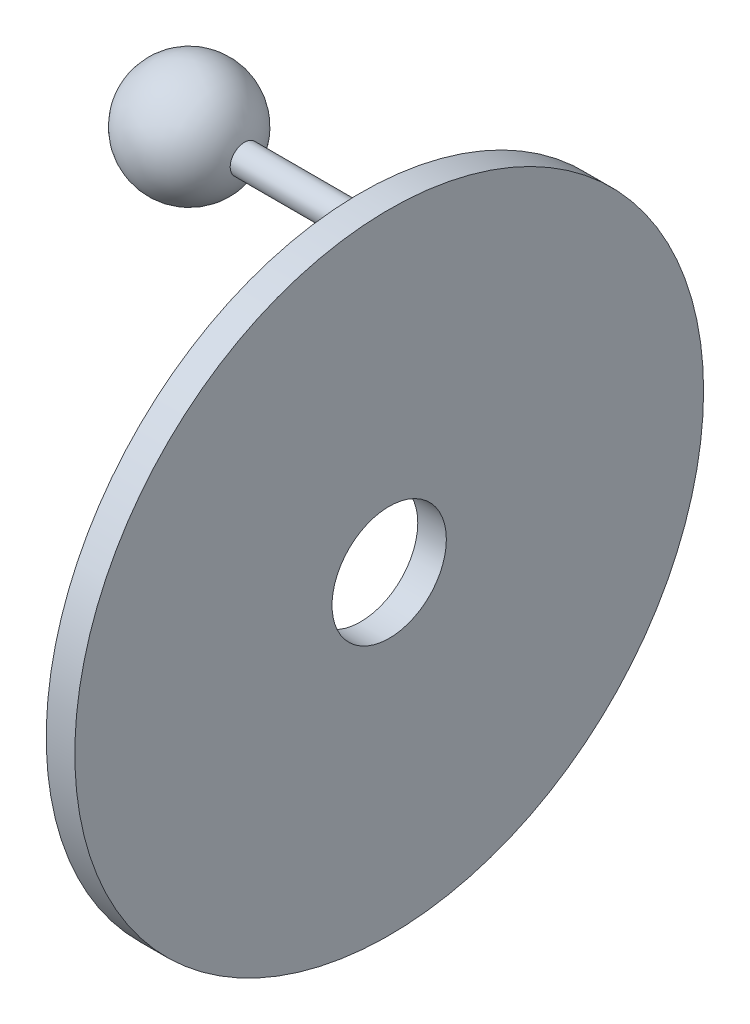
ISO-10303-21;
HEADER;
FILE_DESCRIPTION(('STEP AP214'),'2;1');
FILE_NAME('part.step','',(''),(''),'','','');
FILE_SCHEMA(('AUTOMOTIVE_DESIGN { 1 0 10303 214 1 1 1 1 }'));
ENDSEC;
DATA;
#1=APPLICATION_CONTEXT('core data for automotive mechanical design processes');
#2=APPLICATION_PROTOCOL_DEFINITION('international standard','automotive_design',2000,#1);
#3=PRODUCT_CONTEXT('',#1,'mechanical');
#4=PRODUCT('Part','Part','',(#3));
#5=PRODUCT_RELATED_PRODUCT_CATEGORY('part','',(#4));
#6=PRODUCT_DEFINITION_FORMATION('','',#4);
#7=PRODUCT_DEFINITION_CONTEXT('part definition',#1,'design');
#8=PRODUCT_DEFINITION('design','',#6,#7);
#9=PRODUCT_DEFINITION_SHAPE('','',#8);
#10=(LENGTH_UNIT() NAMED_UNIT(*) SI_UNIT(.MILLI.,.METRE.));
#11=(NAMED_UNIT(*) PLANE_ANGLE_UNIT() SI_UNIT($,.RADIAN.));
#12=(NAMED_UNIT(*) SI_UNIT($,.STERADIAN.) SOLID_ANGLE_UNIT());
#13=UNCERTAINTY_MEASURE_WITH_UNIT(LENGTH_MEASURE(1.E-05),#10,'distance_accuracy_value','');
#14=(GEOMETRIC_REPRESENTATION_CONTEXT(3) GLOBAL_UNCERTAINTY_ASSIGNED_CONTEXT((#13)) GLOBAL_UNIT_ASSIGNED_CONTEXT((#10,
#11,#12)) REPRESENTATION_CONTEXT('',''));
#15=CARTESIAN_POINT('',(0.,0.,0.));
#16=DIRECTION('',(0.,0.,1.));
#17=DIRECTION('',(1.,0.,0.));
#18=AXIS2_PLACEMENT_3D('',#15,#16,#17);
#19=CARTESIAN_POINT('',(0.,0.,0.));
#20=DIRECTION('',(0.,1.,0.));
#21=DIRECTION('',(1.,0.,0.));
#22=AXIS2_PLACEMENT_3D('',#19,#20,#21);
#23=SPHERICAL_SURFACE('',#22,10.);
#24=CARTESIAN_POINT('',(0.,0.,0.));
#25=DIRECTION('',(-1.,0.,0.));
#26=DIRECTION('',(0.,0.,1.));
#27=AXIS2_PLACEMENT_3D('',#24,#25,#26);
#28=SPHERICAL_SURFACE('',#27,10.);
#29=CARTESIAN_POINT('',(9.68245836551854,0.,0.));
#30=DIRECTION('',(-1.,0.,0.));
#31=DIRECTION('',(0.,0.,1.));
#32=AXIS2_PLACEMENT_3D('',#29,#30,#31);
#33=CIRCLE('',#32,2.5);
#34=CARTESIAN_POINT('',(9.68245836551854,0.,2.5));
#35=VERTEX_POINT('',#34);
#36=EDGE_CURVE('E10',#35,#35,#33,.F.);
#37=ORIENTED_EDGE('',*,*,#36,.F.);
#38=EDGE_LOOP('',(#37));
#39=FACE_BOUND('',#38,.T.);
#40=ADVANCED_FACE('F14',(#39),#28,.T.);
#41=CARTESIAN_POINT('',(0.,0.,0.));
#42=DIRECTION('',(-1.,0.,0.));
#43=DIRECTION('',(0.,0.,1.));
#44=AXIS2_PLACEMENT_3D('',#41,#42,#43);
#45=CYLINDRICAL_SURFACE('',#44,2.5);
#46=CARTESIAN_POINT('',(30.,0.,0.));
#47=DIRECTION('',(1.,0.,0.));
#48=DIRECTION('',(0.,0.,-1.));
#49=AXIS2_PLACEMENT_3D('',#46,#47,#48);
#50=CIRCLE('',#49,2.5);
#51=CARTESIAN_POINT('',(30.,0.,-2.5));
#52=VERTEX_POINT('',#51);
#53=EDGE_CURVE('E20',#52,#52,#50,.T.);
#54=ORIENTED_EDGE('',*,*,#53,.F.);
#55=EDGE_LOOP('',(#54));
#56=FACE_BOUND('',#55,.T.);
#57=ORIENTED_EDGE('',*,*,#36,.T.);
#58=EDGE_LOOP('',(#57));
#59=FACE_BOUND('',#58,.T.);
#60=ADVANCED_FACE('F56',(#56,#59),#45,.T.);
#61=CARTESIAN_POINT('',(30.,-50.,0.));
#62=DIRECTION('',(1.,0.,0.));
#63=DIRECTION('',(0.,0.,-1.));
#64=AXIS2_PLACEMENT_3D('',#61,#62,#63);
#65=PLANE('',#64);
#66=CARTESIAN_POINT('',(30.,-50.,0.));
#67=DIRECTION('',(1.,0.,0.));
#68=DIRECTION('',(0.,0.,-1.));
#69=AXIS2_PLACEMENT_3D('',#66,#67,#68);
#70=CIRCLE('',#69,10.);
#71=CARTESIAN_POINT('',(30.,-50.,-10.));
#72=VERTEX_POINT('',#71);
#73=EDGE_CURVE('E34',#72,#72,#70,.T.);
#74=ORIENTED_EDGE('',*,*,#73,.T.);
#75=EDGE_LOOP('',(#74));
#76=FACE_BOUND('',#75,.T.);
#77=CARTESIAN_POINT('',(30.,-50.,0.));
#78=DIRECTION('',(1.,0.,0.));
#79=DIRECTION('',(0.,0.,-1.));
#80=AXIS2_PLACEMENT_3D('',#77,#78,#79);
#81=CIRCLE('',#80,55.);
#82=CARTESIAN_POINT('',(30.,-50.,-55.));
#83=VERTEX_POINT('',#82);
#84=EDGE_CURVE('E28',#83,#83,#81,.T.);
#85=ORIENTED_EDGE('',*,*,#84,.F.);
#86=EDGE_LOOP('',(#85));
#87=FACE_BOUND('',#86,.T.);
#88=ORIENTED_EDGE('',*,*,#53,.T.);
#89=EDGE_LOOP('',(#88));
#90=FACE_BOUND('',#89,.T.);
#91=ADVANCED_FACE('F46',(#76,#87,#90),#65,.F.);
#92=CARTESIAN_POINT('',(35.,-50.,0.));
#93=DIRECTION('',(1.,0.,0.));
#94=DIRECTION('',(0.,0.,-1.));
#95=AXIS2_PLACEMENT_3D('',#92,#93,#94);
#96=PLANE('',#95);
#97=CARTESIAN_POINT('',(35.,-50.,0.));
#98=DIRECTION('',(1.,0.,0.));
#99=DIRECTION('',(0.,0.,-1.));
#100=AXIS2_PLACEMENT_3D('',#97,#98,#99);
#101=CIRCLE('',#100,55.);
#102=CARTESIAN_POINT('',(35.,-50.,-55.));
#103=VERTEX_POINT('',#102);
#104=EDGE_CURVE('E24',#103,#103,#101,.T.);
#105=ORIENTED_EDGE('',*,*,#104,.T.);
#106=EDGE_LOOP('',(#105));
#107=FACE_BOUND('',#106,.T.);
#108=CARTESIAN_POINT('',(35.,-50.,0.));
#109=DIRECTION('',(1.,0.,0.));
#110=DIRECTION('',(0.,0.,-1.));
#111=AXIS2_PLACEMENT_3D('',#108,#109,#110);
#112=CIRCLE('',#111,10.);
#113=CARTESIAN_POINT('',(35.,-50.,-10.));
#114=VERTEX_POINT('',#113);
#115=EDGE_CURVE('E32',#114,#114,#112,.T.);
#116=ORIENTED_EDGE('',*,*,#115,.F.);
#117=EDGE_LOOP('',(#116));
#118=FACE_BOUND('',#117,.T.);
#119=ADVANCED_FACE('F43',(#107,#118),#96,.T.);
#120=CARTESIAN_POINT('',(35.,-50.,0.));
#121=DIRECTION('',(-1.,0.,0.));
#122=DIRECTION('',(0.,0.,1.));
#123=AXIS2_PLACEMENT_3D('',#120,#121,#122);
#124=CYLINDRICAL_SURFACE('',#123,55.);
#125=ORIENTED_EDGE('',*,*,#104,.F.);
#126=EDGE_LOOP('',(#125));
#127=FACE_BOUND('',#126,.T.);
#128=ORIENTED_EDGE('',*,*,#84,.T.);
#129=EDGE_LOOP('',(#128));
#130=FACE_BOUND('',#129,.T.);
#131=ADVANCED_FACE('F45',(#127,#130),#124,.T.);
#132=CARTESIAN_POINT('',(35.,-50.,0.));
#133=DIRECTION('',(-1.,0.,0.));
#134=DIRECTION('',(0.,0.,1.));
#135=AXIS2_PLACEMENT_3D('',#132,#133,#134);
#136=CYLINDRICAL_SURFACE('',#135,10.);
#137=ORIENTED_EDGE('',*,*,#115,.T.);
#138=EDGE_LOOP('',(#137));
#139=FACE_BOUND('',#138,.T.);
#140=ORIENTED_EDGE('',*,*,#73,.F.);
#141=EDGE_LOOP('',(#140));
#142=FACE_BOUND('',#141,.T.);
#143=ADVANCED_FACE('F40',(#139,#142),#136,.F.);
#144=CLOSED_SHELL('',(#40,#60,#91,#119,#131,#143));
#145=MANIFOLD_SOLID_BREP('B1',#144);
#146=ADVANCED_BREP_SHAPE_REPRESENTATION('',(#18,#145),#14);
#147=SHAPE_DEFINITION_REPRESENTATION(#9,#146);
ENDSEC;
END-ISO-10303-21;
